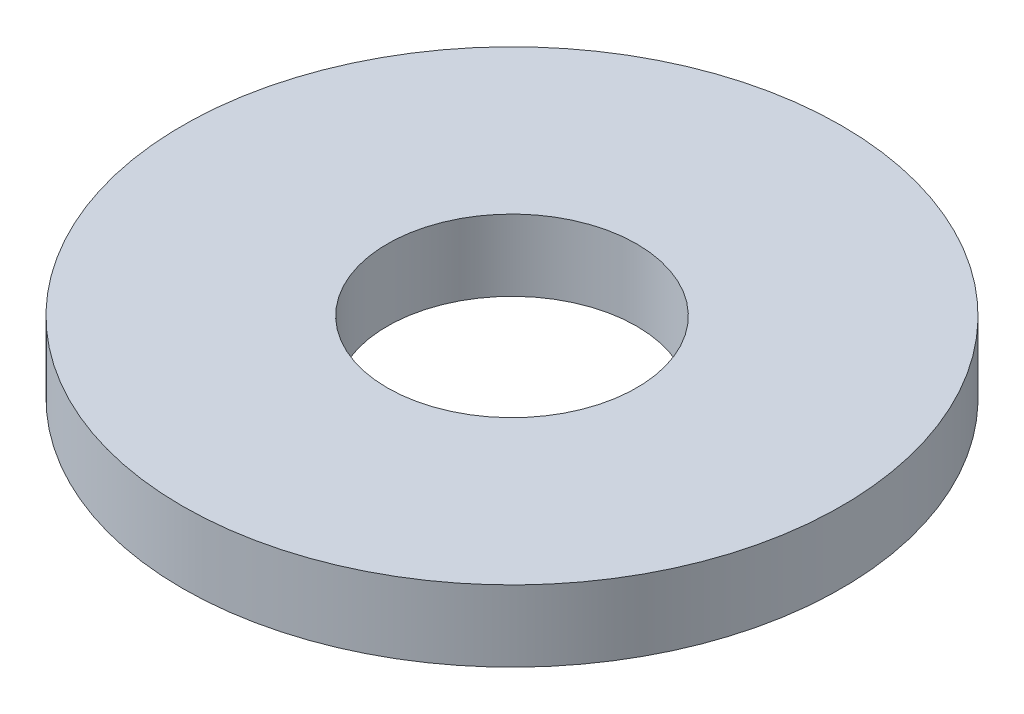
ISO-10303-21;
HEADER;
FILE_DESCRIPTION(('STEP AP214'),'2;1');
FILE_NAME('part.step','',(''),(''),'','','');
FILE_SCHEMA(('AUTOMOTIVE_DESIGN { 1 0 10303 214 1 1 1 1 }'));
ENDSEC;
DATA;
#1=APPLICATION_CONTEXT('core data for automotive mechanical design processes');
#2=APPLICATION_PROTOCOL_DEFINITION('international standard','automotive_design',2000,#1);
#3=PRODUCT_CONTEXT('',#1,'mechanical');
#4=PRODUCT('Part','Part','',(#3));
#5=PRODUCT_RELATED_PRODUCT_CATEGORY('part','',(#4));
#6=PRODUCT_DEFINITION_FORMATION('','',#4);
#7=PRODUCT_DEFINITION_CONTEXT('part definition',#1,'design');
#8=PRODUCT_DEFINITION('design','',#6,#7);
#9=PRODUCT_DEFINITION_SHAPE('','',#8);
#10=(LENGTH_UNIT() NAMED_UNIT(*) SI_UNIT(.MILLI.,.METRE.));
#11=(NAMED_UNIT(*) PLANE_ANGLE_UNIT() SI_UNIT($,.RADIAN.));
#12=(NAMED_UNIT(*) SI_UNIT($,.STERADIAN.) SOLID_ANGLE_UNIT());
#13=UNCERTAINTY_MEASURE_WITH_UNIT(LENGTH_MEASURE(1.E-05),#10,'distance_accuracy_value','');
#14=(GEOMETRIC_REPRESENTATION_CONTEXT(3) GLOBAL_UNCERTAINTY_ASSIGNED_CONTEXT((#13)) GLOBAL_UNIT_ASSIGNED_CONTEXT((#10,
#11,#12)) REPRESENTATION_CONTEXT('',''));
#15=CARTESIAN_POINT('',(0.,0.,0.));
#16=DIRECTION('',(0.,0.,1.));
#17=DIRECTION('',(1.,0.,0.));
#18=AXIS2_PLACEMENT_3D('',#15,#16,#17);
#19=CARTESIAN_POINT('',(0.,20.,0.));
#20=DIRECTION('',(0.,-1.,0.));
#21=DIRECTION('',(0.,0.,-1.));
#22=AXIS2_PLACEMENT_3D('',#19,#20,#21);
#23=CYLINDRICAL_SURFACE('',#22,92.5);
#24=CARTESIAN_POINT('',(0.,20.,0.));
#25=DIRECTION('',(0.,1.,0.));
#26=DIRECTION('',(0.,0.,1.));
#27=AXIS2_PLACEMENT_3D('',#24,#25,#26);
#28=CIRCLE('',#27,92.5);
#29=CARTESIAN_POINT('',(0.,20.,92.5));
#30=VERTEX_POINT('',#29);
#31=EDGE_CURVE('E10',#30,#30,#28,.T.);
#32=ORIENTED_EDGE('',*,*,#31,.F.);
#33=EDGE_LOOP('',(#32));
#34=FACE_BOUND('',#33,.T.);
#35=CARTESIAN_POINT('',(0.,0.,0.));
#36=DIRECTION('',(0.,1.,0.));
#37=DIRECTION('',(0.,0.,1.));
#38=AXIS2_PLACEMENT_3D('',#35,#36,#37);
#39=CIRCLE('',#38,92.5);
#40=CARTESIAN_POINT('',(0.,0.,92.5));
#41=VERTEX_POINT('',#40);
#42=EDGE_CURVE('E37',#41,#41,#39,.T.);
#43=ORIENTED_EDGE('',*,*,#42,.T.);
#44=EDGE_LOOP('',(#43));
#45=FACE_BOUND('',#44,.T.);
#46=ADVANCED_FACE('F40',(#34,#45),#23,.T.);
#47=CARTESIAN_POINT('',(0.,20.,0.));
#48=DIRECTION('',(0.,1.,0.));
#49=DIRECTION('',(0.,0.,1.));
#50=AXIS2_PLACEMENT_3D('',#47,#48,#49);
#51=PLANE('',#50);
#52=CARTESIAN_POINT('',(0.,20.,0.));
#53=DIRECTION('',(0.,1.,0.));
#54=DIRECTION('',(0.,0.,1.));
#55=AXIS2_PLACEMENT_3D('',#52,#53,#54);
#56=CIRCLE('',#55,35.);
#57=CARTESIAN_POINT('',(0.,20.,35.));
#58=VERTEX_POINT('',#57);
#59=EDGE_CURVE('E50',#58,#58,#56,.T.);
#60=ORIENTED_EDGE('',*,*,#59,.F.);
#61=EDGE_LOOP('',(#60));
#62=FACE_BOUND('',#61,.T.);
#63=ORIENTED_EDGE('',*,*,#31,.T.);
#64=EDGE_LOOP('',(#63));
#65=FACE_BOUND('',#64,.T.);
#66=ADVANCED_FACE('F59',(#62,#65),#51,.T.);
#67=CARTESIAN_POINT('',(0.,0.,0.));
#68=DIRECTION('',(0.,1.,0.));
#69=DIRECTION('',(0.,0.,1.));
#70=AXIS2_PLACEMENT_3D('',#67,#68,#69);
#71=PLANE('',#70);
#72=CARTESIAN_POINT('',(0.,0.,0.));
#73=DIRECTION('',(0.,1.,0.));
#74=DIRECTION('',(0.,0.,1.));
#75=AXIS2_PLACEMENT_3D('',#72,#73,#74);
#76=CIRCLE('',#75,35.);
#77=CARTESIAN_POINT('',(0.,0.,35.));
#78=VERTEX_POINT('',#77);
#79=EDGE_CURVE('E47',#78,#78,#76,.T.);
#80=ORIENTED_EDGE('',*,*,#79,.T.);
#81=EDGE_LOOP('',(#80));
#82=FACE_BOUND('',#81,.T.);
#83=ORIENTED_EDGE('',*,*,#42,.F.);
#84=EDGE_LOOP('',(#83));
#85=FACE_BOUND('',#84,.T.);
#86=ADVANCED_FACE('F58',(#82,#85),#71,.F.);
#87=CARTESIAN_POINT('',(0.,20.,0.));
#88=DIRECTION('',(0.,-1.,0.));
#89=DIRECTION('',(0.,0.,-1.));
#90=AXIS2_PLACEMENT_3D('',#87,#88,#89);
#91=CYLINDRICAL_SURFACE('',#90,35.);
#92=ORIENTED_EDGE('',*,*,#59,.T.);
#93=EDGE_LOOP('',(#92));
#94=FACE_BOUND('',#93,.T.);
#95=ORIENTED_EDGE('',*,*,#79,.F.);
#96=EDGE_LOOP('',(#95));
#97=FACE_BOUND('',#96,.T.);
#98=ADVANCED_FACE('F54',(#94,#97),#91,.F.);
#99=CLOSED_SHELL('',(#46,#66,#86,#98));
#100=MANIFOLD_SOLID_BREP('B2',#99);
#101=ADVANCED_BREP_SHAPE_REPRESENTATION('',(#18,#100),#14);
#102=SHAPE_DEFINITION_REPRESENTATION(#9,#101);
ENDSEC;
END-ISO-10303-21;
